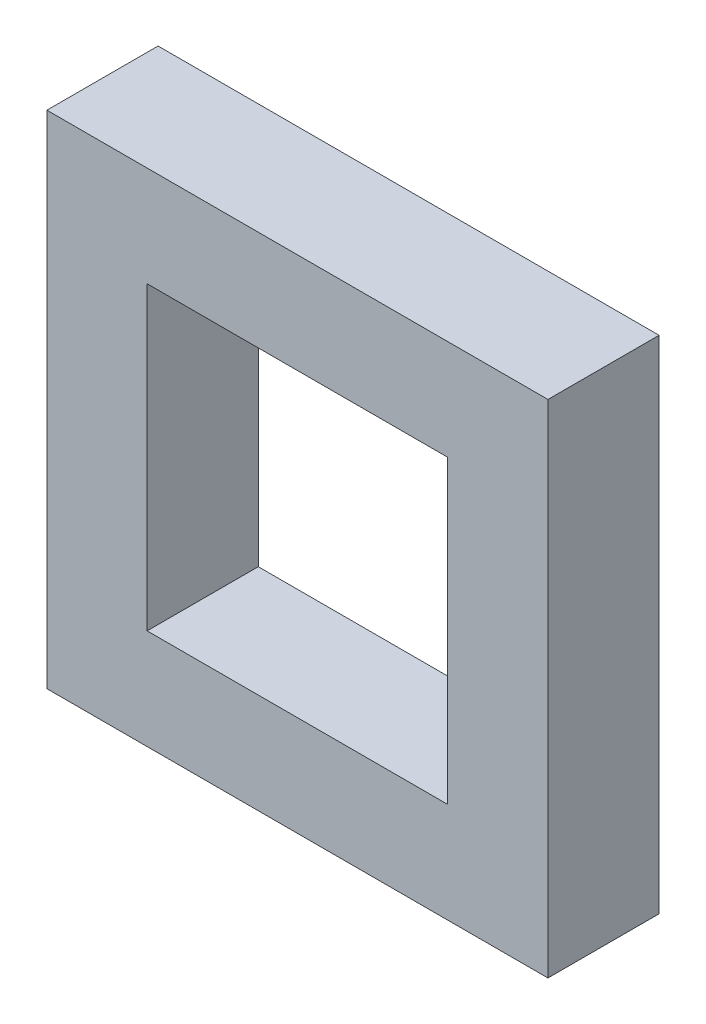
ISO-10303-21;
HEADER;
FILE_DESCRIPTION(('STEP AP214'),'2;1');
FILE_NAME('part.step','',(''),(''),'','','');
FILE_SCHEMA(('AUTOMOTIVE_DESIGN { 1 0 10303 214 1 1 1 1 }'));
ENDSEC;
DATA;
#1=APPLICATION_CONTEXT('core data for automotive mechanical design processes');
#2=APPLICATION_PROTOCOL_DEFINITION('international standard','automotive_design',2000,#1);
#3=PRODUCT_CONTEXT('',#1,'mechanical');
#4=PRODUCT('Part','Part','',(#3));
#5=PRODUCT_RELATED_PRODUCT_CATEGORY('part','',(#4));
#6=PRODUCT_DEFINITION_FORMATION('','',#4);
#7=PRODUCT_DEFINITION_CONTEXT('part definition',#1,'design');
#8=PRODUCT_DEFINITION('design','',#6,#7);
#9=PRODUCT_DEFINITION_SHAPE('','',#8);
#10=(LENGTH_UNIT() NAMED_UNIT(*) SI_UNIT(.MILLI.,.METRE.));
#11=(NAMED_UNIT(*) PLANE_ANGLE_UNIT() SI_UNIT($,.RADIAN.));
#12=(NAMED_UNIT(*) SI_UNIT($,.STERADIAN.) SOLID_ANGLE_UNIT());
#13=UNCERTAINTY_MEASURE_WITH_UNIT(LENGTH_MEASURE(1.E-05),#10,'distance_accuracy_value','');
#14=(GEOMETRIC_REPRESENTATION_CONTEXT(3) GLOBAL_UNCERTAINTY_ASSIGNED_CONTEXT((#13)) GLOBAL_UNIT_ASSIGNED_CONTEXT((#10,
#11,#12)) REPRESENTATION_CONTEXT('',''));
#15=CARTESIAN_POINT('',(0.,0.,0.));
#16=DIRECTION('',(0.,0.,1.));
#17=DIRECTION('',(1.,0.,0.));
#18=AXIS2_PLACEMENT_3D('',#15,#16,#17);
#19=CARTESIAN_POINT('',(2.57846680820418,11.7057973977912,0.15));
#20=DIRECTION('',(1.,0.,0.));
#21=DIRECTION('',(0.,1.,0.));
#22=AXIS2_PLACEMENT_3D('',#19,#20,#21);
#23=PLANE('',#22);
#24=DIRECTION('',(0.,1.,0.));
#25=VECTOR('',#24,1.);
#26=CARTESIAN_POINT('',(2.57846680820418,11.7057973977912,0.15));
#27=LINE('',#26,#25);
#28=CARTESIAN_POINT('',(2.57846680820418,11.7057973977912,0.15));
#29=VERTEX_POINT('',#28);
#30=CARTESIAN_POINT('',(2.57846680820418,12.0033127987378,0.15));
#31=VERTEX_POINT('',#30);
#32=EDGE_CURVE('E145',#29,#31,#27,.T.);
#33=ORIENTED_EDGE('',*,*,#32,.T.);
#34=DIRECTION('',(0.,0.,1.));
#35=VECTOR('',#34,1.);
#36=CARTESIAN_POINT('',(2.57846680820418,12.0033127987378,0.15));
#37=LINE('',#36,#35);
#38=CARTESIAN_POINT('',(2.57846680820418,12.0033127987378,0.26));
#39=VERTEX_POINT('',#38);
#40=EDGE_CURVE('E157',#31,#39,#37,.T.);
#41=ORIENTED_EDGE('',*,*,#40,.T.);
#42=DIRECTION('',(0.,1.,0.));
#43=VECTOR('',#42,1.);
#44=CARTESIAN_POINT('',(2.57846680820418,11.7057973977912,0.26));
#45=LINE('',#44,#43);
#46=CARTESIAN_POINT('',(2.57846680820418,11.7057973977912,0.26));
#47=VERTEX_POINT('',#46);
#48=EDGE_CURVE('E170',#47,#39,#45,.T.);
#49=ORIENTED_EDGE('',*,*,#48,.F.);
#50=DIRECTION('',(0.,0.,1.));
#51=VECTOR('',#50,1.);
#52=CARTESIAN_POINT('',(2.57846680820418,11.7057973977912,0.15));
#53=LINE('',#52,#51);
#54=EDGE_CURVE('E140',#29,#47,#53,.T.);
#55=ORIENTED_EDGE('',*,*,#54,.F.);
#56=EDGE_LOOP('',(#33,#41,#49,#55));
#57=FACE_BOUND('',#56,.T.);
#58=ADVANCED_FACE('F16',(#57),#23,.T.);
#59=CARTESIAN_POINT('',(2.47929500788863,11.6066255974756,0.15));
#60=DIRECTION('',(0.,-1.,0.));
#61=DIRECTION('',(0.,0.,-1.));
#62=AXIS2_PLACEMENT_3D('',#59,#60,#61);
#63=PLANE('',#62);
#64=DIRECTION('',(-1.,0.,0.));
#65=VECTOR('',#64,1.);
#66=CARTESIAN_POINT('',(2.97515400946636,11.6066255974756,0.15));
#67=LINE('',#66,#65);
#68=CARTESIAN_POINT('',(2.97515400946636,11.6066255974756,0.15));
#69=VERTEX_POINT('',#68);
#70=CARTESIAN_POINT('',(2.47929500788863,11.6066255974756,0.15));
#71=VERTEX_POINT('',#70);
#72=EDGE_CURVE('E105',#69,#71,#67,.T.);
#73=ORIENTED_EDGE('',*,*,#72,.F.);
#74=DIRECTION('',(0.,0.,1.));
#75=VECTOR('',#74,1.);
#76=CARTESIAN_POINT('',(2.97515400946636,11.6066255974756,0.15));
#77=LINE('',#76,#75);
#78=CARTESIAN_POINT('',(2.97515400946636,11.6066255974756,0.26));
#79=VERTEX_POINT('',#78);
#80=EDGE_CURVE('E100',#69,#79,#77,.T.);
#81=ORIENTED_EDGE('',*,*,#80,.T.);
#82=DIRECTION('',(1.,0.,0.));
#83=VECTOR('',#82,1.);
#84=CARTESIAN_POINT('',(2.97515400946636,11.6066255974756,0.26));
#85=LINE('',#84,#83);
#86=CARTESIAN_POINT('',(2.47929500788863,11.6066255974756,0.26));
#87=VERTEX_POINT('',#86);
#88=EDGE_CURVE('E164',#87,#79,#85,.T.);
#89=ORIENTED_EDGE('',*,*,#88,.F.);
#90=DIRECTION('',(0.,0.,1.));
#91=VECTOR('',#90,1.);
#92=CARTESIAN_POINT('',(2.47929500788863,11.6066255974756,0.15));
#93=LINE('',#92,#91);
#94=EDGE_CURVE('E11',#71,#87,#93,.T.);
#95=ORIENTED_EDGE('',*,*,#94,.F.);
#96=EDGE_LOOP('',(#73,#81,#89,#95));
#97=FACE_BOUND('',#96,.T.);
#98=ADVANCED_FACE('F405',(#97),#63,.T.);
#99=CARTESIAN_POINT('',(2.47929500788863,12.1024845990534,0.15));
#100=DIRECTION('',(-1.,0.,0.));
#101=DIRECTION('',(0.,0.,1.));
#102=AXIS2_PLACEMENT_3D('',#99,#100,#101);
#103=PLANE('',#102);
#104=DIRECTION('',(0.,1.,0.));
#105=VECTOR('',#104,1.);
#106=CARTESIAN_POINT('',(2.47929500788863,11.6066255974756,0.15));
#107=LINE('',#106,#105);
#108=CARTESIAN_POINT('',(2.47929500788863,12.1024845990534,0.15));
#109=VERTEX_POINT('',#108);
#110=EDGE_CURVE('E109',#71,#109,#107,.T.);
#111=ORIENTED_EDGE('',*,*,#110,.F.);
#112=ORIENTED_EDGE('',*,*,#94,.T.);
#113=DIRECTION('',(0.,-1.,0.));
#114=VECTOR('',#113,1.);
#115=CARTESIAN_POINT('',(2.47929500788863,11.6066255974756,0.26));
#116=LINE('',#115,#114);
#117=CARTESIAN_POINT('',(2.47929500788863,12.1024845990534,0.26));
#118=VERTEX_POINT('',#117);
#119=EDGE_CURVE('E126',#118,#87,#116,.T.);
#120=ORIENTED_EDGE('',*,*,#119,.F.);
#121=DIRECTION('',(0.,0.,1.));
#122=VECTOR('',#121,1.);
#123=CARTESIAN_POINT('',(2.47929500788863,12.1024845990534,0.15));
#124=LINE('',#123,#122);
#125=EDGE_CURVE('E27',#109,#118,#124,.T.);
#126=ORIENTED_EDGE('',*,*,#125,.F.);
#127=EDGE_LOOP('',(#111,#112,#120,#126));
#128=FACE_BOUND('',#127,.T.);
#129=ADVANCED_FACE('F383',(#128),#103,.T.);
#130=CARTESIAN_POINT('',(2.97515400946636,12.1024845990534,0.15));
#131=DIRECTION('',(0.,1.,0.));
#132=DIRECTION('',(1.,0.,0.));
#133=AXIS2_PLACEMENT_3D('',#130,#131,#132);
#134=PLANE('',#133);
#135=DIRECTION('',(1.,0.,0.));
#136=VECTOR('',#135,1.);
#137=CARTESIAN_POINT('',(2.47929500788863,12.1024845990534,0.15));
#138=LINE('',#137,#136);
#139=CARTESIAN_POINT('',(2.97515400946636,12.1024845990534,0.15));
#140=VERTEX_POINT('',#139);
#141=EDGE_CURVE('E86',#109,#140,#138,.T.);
#142=ORIENTED_EDGE('',*,*,#141,.F.);
#143=ORIENTED_EDGE('',*,*,#125,.T.);
#144=DIRECTION('',(-1.,0.,0.));
#145=VECTOR('',#144,1.);
#146=CARTESIAN_POINT('',(2.47929500788863,12.1024845990534,0.26));
#147=LINE('',#146,#145);
#148=CARTESIAN_POINT('',(2.97515400946636,12.1024845990534,0.26));
#149=VERTEX_POINT('',#148);
#150=EDGE_CURVE('E88',#149,#118,#147,.T.);
#151=ORIENTED_EDGE('',*,*,#150,.F.);
#152=DIRECTION('',(0.,0.,1.));
#153=VECTOR('',#152,1.);
#154=CARTESIAN_POINT('',(2.97515400946636,12.1024845990534,0.15));
#155=LINE('',#154,#153);
#156=EDGE_CURVE('E82',#140,#149,#155,.T.);
#157=ORIENTED_EDGE('',*,*,#156,.F.);
#158=EDGE_LOOP('',(#142,#143,#151,#157));
#159=FACE_BOUND('',#158,.T.);
#160=ADVANCED_FACE('F84',(#159),#134,.T.);
#161=CARTESIAN_POINT('',(2.7272245086775,11.8545550982645,0.26));
#162=DIRECTION('',(0.,0.,1.));
#163=DIRECTION('',(1.,0.,0.));
#164=AXIS2_PLACEMENT_3D('',#161,#162,#163);
#165=PLANE('',#164);
#166=DIRECTION('',(-1.,0.,0.));
#167=VECTOR('',#166,1.);
#168=CARTESIAN_POINT('',(2.87598220915082,11.7057973977912,0.26));
#169=LINE('',#168,#167);
#170=CARTESIAN_POINT('',(2.87598220915082,11.7057973977912,0.26));
#171=VERTEX_POINT('',#170);
#172=EDGE_CURVE('E144',#171,#47,#169,.T.);
#173=ORIENTED_EDGE('',*,*,#172,.T.);
#174=ORIENTED_EDGE('',*,*,#48,.T.);
#175=DIRECTION('',(1.,0.,0.));
#176=VECTOR('',#175,1.);
#177=CARTESIAN_POINT('',(2.57846680820418,12.0033127987378,0.26));
#178=LINE('',#177,#176);
#179=CARTESIAN_POINT('',(2.87598220915082,12.0033127987378,0.26));
#180=VERTEX_POINT('',#179);
#181=EDGE_CURVE('E117',#39,#180,#178,.T.);
#182=ORIENTED_EDGE('',*,*,#181,.T.);
#183=DIRECTION('',(0.,-1.,0.));
#184=VECTOR('',#183,1.);
#185=CARTESIAN_POINT('',(2.87598220915082,12.0033127987378,0.26));
#186=LINE('',#185,#184);
#187=EDGE_CURVE('E127',#180,#171,#186,.T.);
#188=ORIENTED_EDGE('',*,*,#187,.T.);
#189=EDGE_LOOP('',(#173,#174,#182,#188));
#190=FACE_BOUND('',#189,.T.);
#191=ORIENTED_EDGE('',*,*,#150,.T.);
#192=ORIENTED_EDGE('',*,*,#119,.T.);
#193=ORIENTED_EDGE('',*,*,#88,.T.);
#194=DIRECTION('',(0.,1.,0.));
#195=VECTOR('',#194,1.);
#196=CARTESIAN_POINT('',(2.97515400946636,12.1024845990534,0.26));
#197=LINE('',#196,#195);
#198=EDGE_CURVE('E93',#79,#149,#197,.T.);
#199=ORIENTED_EDGE('',*,*,#198,.T.);
#200=EDGE_LOOP('',(#191,#192,#193,#199));
#201=FACE_BOUND('',#200,.T.);
#202=ADVANCED_FACE('F18',(#190,#201),#165,.T.);
#203=CARTESIAN_POINT('',(2.87598220915082,12.0033127987378,0.15));
#204=DIRECTION('',(-1.,0.,0.));
#205=DIRECTION('',(0.,0.,1.));
#206=AXIS2_PLACEMENT_3D('',#203,#204,#205);
#207=PLANE('',#206);
#208=DIRECTION('',(0.,-1.,0.));
#209=VECTOR('',#208,1.);
#210=CARTESIAN_POINT('',(2.87598220915082,12.0033127987378,0.15));
#211=LINE('',#210,#209);
#212=CARTESIAN_POINT('',(2.87598220915082,12.0033127987378,0.15));
#213=VERTEX_POINT('',#212);
#214=CARTESIAN_POINT('',(2.87598220915082,11.7057973977912,0.15));
#215=VERTEX_POINT('',#214);
#216=EDGE_CURVE('E124',#213,#215,#211,.T.);
#217=ORIENTED_EDGE('',*,*,#216,.T.);
#218=DIRECTION('',(0.,0.,1.));
#219=VECTOR('',#218,1.);
#220=CARTESIAN_POINT('',(2.87598220915082,11.7057973977912,0.15));
#221=LINE('',#220,#219);
#222=EDGE_CURVE('E94',#215,#171,#221,.T.);
#223=ORIENTED_EDGE('',*,*,#222,.T.);
#224=ORIENTED_EDGE('',*,*,#187,.F.);
#225=DIRECTION('',(0.,0.,1.));
#226=VECTOR('',#225,1.);
#227=CARTESIAN_POINT('',(2.87598220915082,12.0033127987378,0.15));
#228=LINE('',#227,#226);
#229=EDGE_CURVE('E156',#213,#180,#228,.T.);
#230=ORIENTED_EDGE('',*,*,#229,.F.);
#231=EDGE_LOOP('',(#217,#223,#224,#230));
#232=FACE_BOUND('',#231,.T.);
#233=ADVANCED_FACE('F370',(#232),#207,.T.);
#234=CARTESIAN_POINT('',(2.57846680820418,12.0033127987378,0.15));
#235=DIRECTION('',(0.,-1.,0.));
#236=DIRECTION('',(0.,0.,-1.));
#237=AXIS2_PLACEMENT_3D('',#234,#235,#236);
#238=PLANE('',#237);
#239=DIRECTION('',(1.,0.,0.));
#240=VECTOR('',#239,1.);
#241=CARTESIAN_POINT('',(2.57846680820418,12.0033127987378,0.15));
#242=LINE('',#241,#240);
#243=EDGE_CURVE('E20',#31,#213,#242,.T.);
#244=ORIENTED_EDGE('',*,*,#243,.T.);
#245=ORIENTED_EDGE('',*,*,#229,.T.);
#246=ORIENTED_EDGE('',*,*,#181,.F.);
#247=ORIENTED_EDGE('',*,*,#40,.F.);
#248=EDGE_LOOP('',(#244,#245,#246,#247));
#249=FACE_BOUND('',#248,.T.);
#250=ADVANCED_FACE('F374',(#249),#238,.T.);
#251=CARTESIAN_POINT('',(2.97515400946636,11.6066255974756,0.15));
#252=DIRECTION('',(1.,0.,0.));
#253=DIRECTION('',(0.,1.,0.));
#254=AXIS2_PLACEMENT_3D('',#251,#252,#253);
#255=PLANE('',#254);
#256=DIRECTION('',(0.,-1.,0.));
#257=VECTOR('',#256,1.);
#258=CARTESIAN_POINT('',(2.97515400946636,12.1024845990534,0.15));
#259=LINE('',#258,#257);
#260=EDGE_CURVE('E97',#140,#69,#259,.T.);
#261=ORIENTED_EDGE('',*,*,#260,.F.);
#262=ORIENTED_EDGE('',*,*,#156,.T.);
#263=ORIENTED_EDGE('',*,*,#198,.F.);
#264=ORIENTED_EDGE('',*,*,#80,.F.);
#265=EDGE_LOOP('',(#261,#262,#263,#264));
#266=FACE_BOUND('',#265,.T.);
#267=ADVANCED_FACE('F98',(#266),#255,.T.);
#268=CARTESIAN_POINT('',(2.87598220915082,11.7057973977912,0.15));
#269=DIRECTION('',(0.,1.,0.));
#270=DIRECTION('',(1.,0.,0.));
#271=AXIS2_PLACEMENT_3D('',#268,#269,#270);
#272=PLANE('',#271);
#273=DIRECTION('',(-1.,0.,0.));
#274=VECTOR('',#273,1.);
#275=CARTESIAN_POINT('',(2.87598220915082,11.7057973977912,0.15));
#276=LINE('',#275,#274);
#277=EDGE_CURVE('E120',#215,#29,#276,.T.);
#278=ORIENTED_EDGE('',*,*,#277,.T.);
#279=ORIENTED_EDGE('',*,*,#54,.T.);
#280=ORIENTED_EDGE('',*,*,#172,.F.);
#281=ORIENTED_EDGE('',*,*,#222,.F.);
#282=EDGE_LOOP('',(#278,#279,#280,#281));
#283=FACE_BOUND('',#282,.T.);
#284=ADVANCED_FACE('F188',(#283),#272,.T.);
#285=CARTESIAN_POINT('',(2.7272245086775,11.8545550982645,0.15));
#286=DIRECTION('',(0.,0.,1.));
#287=DIRECTION('',(1.,0.,0.));
#288=AXIS2_PLACEMENT_3D('',#285,#286,#287);
#289=PLANE('',#288);
#290=ORIENTED_EDGE('',*,*,#277,.F.);
#291=ORIENTED_EDGE('',*,*,#216,.F.);
#292=ORIENTED_EDGE('',*,*,#243,.F.);
#293=ORIENTED_EDGE('',*,*,#32,.F.);
#294=EDGE_LOOP('',(#290,#291,#292,#293));
#295=FACE_BOUND('',#294,.T.);
#296=ORIENTED_EDGE('',*,*,#141,.T.);
#297=ORIENTED_EDGE('',*,*,#260,.T.);
#298=ORIENTED_EDGE('',*,*,#72,.T.);
#299=ORIENTED_EDGE('',*,*,#110,.T.);
#300=EDGE_LOOP('',(#296,#297,#298,#299));
#301=FACE_BOUND('',#300,.T.);
#302=ADVANCED_FACE('F108',(#295,#301),#289,.F.);
#303=CLOSED_SHELL('',(#58,#98,#129,#160,#202,#233,#250,#267,#284,#302));
#304=MANIFOLD_SOLID_BREP('B1',#303);
#305=ADVANCED_BREP_SHAPE_REPRESENTATION('',(#18,#304),#14);
#306=SHAPE_DEFINITION_REPRESENTATION(#9,#305);
ENDSEC;
END-ISO-10303-21;
